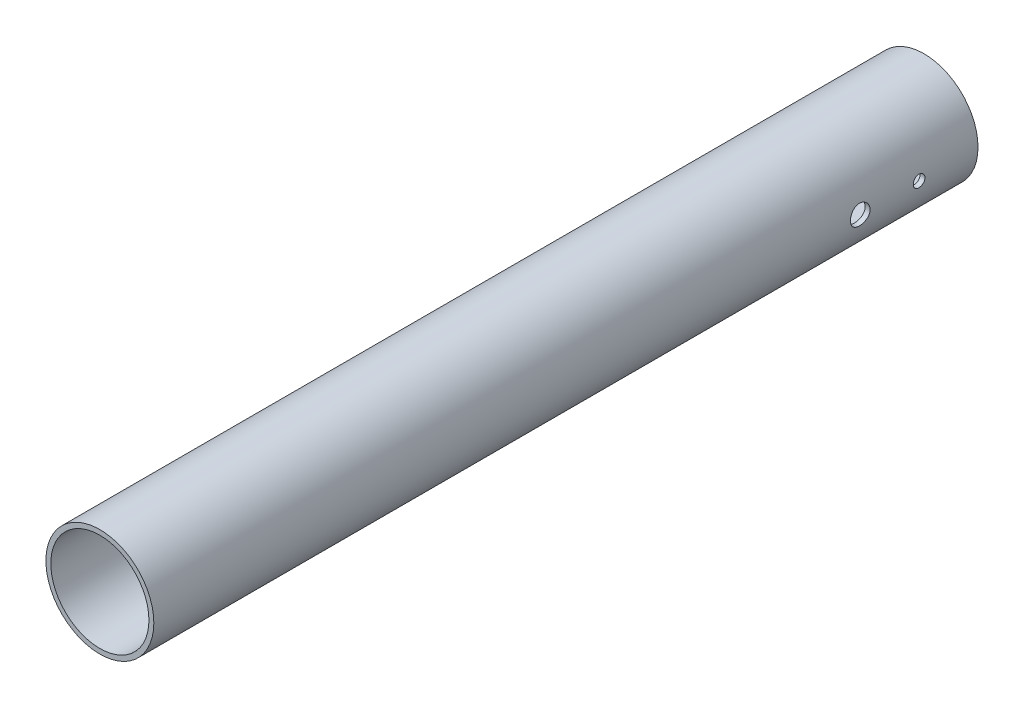
ISO-10303-21;
HEADER;
FILE_DESCRIPTION(('STEP AP214'),'2;1');
FILE_NAME('part.step','',(''),(''),'','','');
FILE_SCHEMA(('AUTOMOTIVE_DESIGN { 1 0 10303 214 1 1 1 1 }'));
ENDSEC;
DATA;
#1=APPLICATION_CONTEXT('core data for automotive mechanical design processes');
#2=APPLICATION_PROTOCOL_DEFINITION('international standard','automotive_design',2000,#1);
#3=PRODUCT_CONTEXT('',#1,'mechanical');
#4=PRODUCT('Part','Part','',(#3));
#5=PRODUCT_RELATED_PRODUCT_CATEGORY('part','',(#4));
#6=PRODUCT_DEFINITION_FORMATION('','',#4);
#7=PRODUCT_DEFINITION_CONTEXT('part definition',#1,'design');
#8=PRODUCT_DEFINITION('design','',#6,#7);
#9=PRODUCT_DEFINITION_SHAPE('','',#8);
#10=(LENGTH_UNIT() NAMED_UNIT(*) SI_UNIT(.MILLI.,.METRE.));
#11=(NAMED_UNIT(*) PLANE_ANGLE_UNIT() SI_UNIT($,.RADIAN.));
#12=(NAMED_UNIT(*) SI_UNIT($,.STERADIAN.) SOLID_ANGLE_UNIT());
#13=UNCERTAINTY_MEASURE_WITH_UNIT(LENGTH_MEASURE(1.E-05),#10,'distance_accuracy_value','');
#14=(GEOMETRIC_REPRESENTATION_CONTEXT(3) GLOBAL_UNCERTAINTY_ASSIGNED_CONTEXT((#13)) GLOBAL_UNIT_ASSIGNED_CONTEXT((#10,
#11,#12)) REPRESENTATION_CONTEXT('',''));
#15=CARTESIAN_POINT('',(0.,0.,0.));
#16=DIRECTION('',(0.,0.,1.));
#17=DIRECTION('',(1.,0.,0.));
#18=AXIS2_PLACEMENT_3D('',#15,#16,#17);
#19=CARTESIAN_POINT('',(0.,0.,266.7));
#20=DIRECTION('',(0.,0.,1.));
#21=DIRECTION('',(1.,0.,0.));
#22=AXIS2_PLACEMENT_3D('',#19,#20,#21);
#23=PLANE('',#22);
#24=CARTESIAN_POINT('',(0.,0.,266.7));
#25=DIRECTION('',(0.,0.,1.));
#26=DIRECTION('',(1.,0.,0.));
#27=AXIS2_PLACEMENT_3D('',#24,#25,#26);
#28=CIRCLE('',#27,17.4625);
#29=CARTESIAN_POINT('',(17.4625,0.,266.7));
#30=VERTEX_POINT('',#29);
#31=EDGE_CURVE('E58',#30,#30,#28,.T.);
#32=ORIENTED_EDGE('',*,*,#31,.T.);
#33=EDGE_LOOP('',(#32));
#34=FACE_BOUND('',#33,.T.);
#35=CARTESIAN_POINT('',(0.,0.,266.7));
#36=DIRECTION('',(0.,0.,1.));
#37=DIRECTION('',(1.,0.,0.));
#38=AXIS2_PLACEMENT_3D('',#35,#36,#37);
#39=CIRCLE('',#38,15.875);
#40=CARTESIAN_POINT('',(15.875,0.,266.7));
#41=VERTEX_POINT('',#40);
#42=EDGE_CURVE('E100',#41,#41,#39,.T.);
#43=ORIENTED_EDGE('',*,*,#42,.F.);
#44=EDGE_LOOP('',(#43));
#45=FACE_BOUND('',#44,.T.);
#46=ADVANCED_FACE('F43',(#34,#45),#23,.T.);
#47=CARTESIAN_POINT('',(0.,0.,0.));
#48=DIRECTION('',(0.,0.,1.));
#49=DIRECTION('',(1.,0.,0.));
#50=AXIS2_PLACEMENT_3D('',#47,#48,#49);
#51=PLANE('',#50);
#52=CARTESIAN_POINT('',(0.,0.,0.));
#53=DIRECTION('',(0.,0.,1.));
#54=DIRECTION('',(1.,0.,0.));
#55=AXIS2_PLACEMENT_3D('',#52,#53,#54);
#56=CIRCLE('',#55,17.4625);
#57=CARTESIAN_POINT('',(17.4625,0.,0.));
#58=VERTEX_POINT('',#57);
#59=EDGE_CURVE('E62',#58,#58,#56,.T.);
#60=ORIENTED_EDGE('',*,*,#59,.F.);
#61=EDGE_LOOP('',(#60));
#62=FACE_BOUND('',#61,.T.);
#63=CARTESIAN_POINT('',(0.,0.,0.));
#64=DIRECTION('',(0.,0.,1.));
#65=DIRECTION('',(1.,0.,0.));
#66=AXIS2_PLACEMENT_3D('',#63,#64,#65);
#67=CIRCLE('',#66,15.875);
#68=CARTESIAN_POINT('',(15.875,0.,0.));
#69=VERTEX_POINT('',#68);
#70=EDGE_CURVE('E99',#69,#69,#67,.T.);
#71=ORIENTED_EDGE('',*,*,#70,.T.);
#72=EDGE_LOOP('',(#71));
#73=FACE_BOUND('',#72,.T.);
#74=ADVANCED_FACE('F106',(#62,#73),#51,.F.);
#75=CARTESIAN_POINT('',(0.,0.,266.7));
#76=DIRECTION('',(0.,0.,-1.));
#77=DIRECTION('',(-1.,0.,0.));
#78=AXIS2_PLACEMENT_3D('',#75,#76,#77);
#79=CYLINDRICAL_SURFACE('',#78,17.4625);
#80=CARTESIAN_POINT('',(17.4625,0.,34.925));
#81=CARTESIAN_POINT('',(17.4624968365547,-0.176779668735442,34.9250068558738));
#82=CARTESIAN_POINT('',(17.4597877996433,-0.353649676745146,34.9398141650037));
#83=CARTESIAN_POINT('',(17.4492419540942,-0.70241224587169,34.9986178773146));
#84=CARTESIAN_POINT('',(17.4414007077203,-0.87430036478489,35.0426395421229));
#85=CARTESIAN_POINT('',(17.4214682563567,-1.20800427136557,35.1584849433527));
#86=CARTESIAN_POINT('',(17.4093807884192,-1.36982876898915,35.2302842386013));
#87=CARTESIAN_POINT('',(17.3822784100355,-1.6791178053729,35.399578888267));
#88=CARTESIAN_POINT('',(17.3672637641222,-1.82658363994048,35.4970719209863));
#89=CARTESIAN_POINT('',(17.3357767568098,-2.1046510493134,35.7161558815578));
#90=CARTESIAN_POINT('',(17.3192911899786,-2.23506700882811,35.8379805241445));
#91=CARTESIAN_POINT('',(17.2868192364874,-2.47372754778962,36.1017666871176));
#92=CARTESIAN_POINT('',(17.2708328844662,-2.58197059162026,36.2437296010565));
#93=CARTESIAN_POINT('',(17.24104121333,-2.77397678338656,36.5450639580174));
#94=CARTESIAN_POINT('',(17.2272529328728,-2.85755259809069,36.7045565996782));
#95=CARTESIAN_POINT('',(17.2036038845208,-2.9966530578309,37.0356108573893));
#96=CARTESIAN_POINT('',(17.1937427990208,-3.05217997137198,37.2071714961398));
#97=CARTESIAN_POINT('',(17.1791971870777,-3.13301376366712,37.5555107558536));
#98=CARTESIAN_POINT('',(17.1744574058797,-3.15864345450393,37.732212114339));
#99=CARTESIAN_POINT('',(17.1705243239879,-3.17995694869492,38.0874657466119));
#100=CARTESIAN_POINT('',(17.1713305558931,-3.17564327558419,38.2660178631567));
#101=CARTESIAN_POINT('',(17.1783480576557,-3.13745458402862,38.6175756636862));
#102=CARTESIAN_POINT('',(17.1844924409264,-3.10394536847276,38.7906226152845));
#103=CARTESIAN_POINT('',(17.2013889727233,-3.00889230802291,39.1285968416579));
#104=CARTESIAN_POINT('',(17.212141306413,-2.9473473365481,39.293523789846));
#105=CARTESIAN_POINT('',(17.2371128071494,-2.79760835240506,39.6116536803612));
#106=CARTESIAN_POINT('',(17.2513512559653,-2.70926544714818,39.7647849652325));
#107=CARTESIAN_POINT('',(17.281677749436,-2.50854374106292,40.0541882699007));
#108=CARTESIAN_POINT('',(17.2977659708751,-2.39616264199939,40.1904586757009));
#109=CARTESIAN_POINT('',(17.3302714228357,-2.14857646576633,40.4443866568554));
#110=CARTESIAN_POINT('',(17.3466899988364,-2.01305822409282,40.5617389303936));
#111=CARTESIAN_POINT('',(17.3777870381888,-1.72409570835062,40.7720881494008));
#112=CARTESIAN_POINT('',(17.392465486011,-1.57065127432832,40.8650848775238));
#113=CARTESIAN_POINT('',(17.4184554129773,-1.24988256261445,41.0241232312837));
#114=CARTESIAN_POINT('',(17.4297630918777,-1.08254288887784,41.0901344640549));
#115=CARTESIAN_POINT('',(17.4477077618503,-0.738899357959478,41.1930265680837));
#116=CARTESIAN_POINT('',(17.4543452190194,-0.562596397214249,41.2299103463611));
#117=CARTESIAN_POINT('',(17.4621379448862,-0.208658856205865,41.2730787470466));
#118=CARTESIAN_POINT('',(17.4633681932907,-0.03107691922293,41.2797819047333));
#119=CARTESIAN_POINT('',(17.4604145051791,0.322670866866413,41.2635195203869));
#120=CARTESIAN_POINT('',(17.4562308181758,0.49883678085677,41.2405553456361));
#121=CARTESIAN_POINT('',(17.4429659495402,0.843434142428505,41.1659581975705));
#122=CARTESIAN_POINT('',(17.4339207387081,1.01191265971508,41.1145357076723));
#123=CARTESIAN_POINT('',(17.4119428100653,1.33785723308862,40.9847084347214));
#124=CARTESIAN_POINT('',(17.3990098407924,1.49532257602551,40.9063019062799));
#125=CARTESIAN_POINT('',(17.3705040509094,1.79656620473146,40.7237967624878));
#126=CARTESIAN_POINT('',(17.3549053081318,1.94018606768474,40.61944078414));
#127=CARTESIAN_POINT('',(17.3228680731285,2.20802539442976,40.3883489020346));
#128=CARTESIAN_POINT('',(17.3064295075713,2.33224316021752,40.2616110415585));
#129=CARTESIAN_POINT('',(17.2743183779776,2.55933158896691,39.9874630757005));
#130=CARTESIAN_POINT('',(17.2586578899349,2.66191740827001,39.8398153758902));
#131=CARTESIAN_POINT('',(17.2301139725362,2.84083103651321,39.5291370620172));
#132=CARTESIAN_POINT('',(17.2172304439237,2.91715978401387,39.3661069980635));
#133=CARTESIAN_POINT('',(17.1957927707707,3.04098238071272,39.0300356848644));
#134=CARTESIAN_POINT('',(17.1872185785159,3.0886099623067,38.8570450462033));
#135=CARTESIAN_POINT('',(17.1753232589081,3.15409326283453,38.5053475055482));
#136=CARTESIAN_POINT('',(17.1720015781303,3.17195211832635,38.3266412078023));
#137=CARTESIAN_POINT('',(17.1710142653865,3.17729097940304,37.9714357164515));
#138=CARTESIAN_POINT('',(17.1732650333878,3.16521999989456,37.7949433465913));
#139=CARTESIAN_POINT('',(17.1829842513591,3.11202144474092,37.4465474746474));
#140=CARTESIAN_POINT('',(17.1904526744775,3.07089401862826,37.2746439489528));
#141=CARTESIAN_POINT('',(17.2097314567845,2.96093462864081,36.9405277866348));
#142=CARTESIAN_POINT('',(17.2215346338835,2.8921484736803,36.7782996331453));
#143=CARTESIAN_POINT('',(17.2481585680482,2.72887239442906,36.467614315126));
#144=CARTESIAN_POINT('',(17.2629795205642,2.63438080515798,36.3191580434576));
#145=CARTESIAN_POINT('',(17.294230153842,2.42080325564693,36.0379758115795));
#146=CARTESIAN_POINT('',(17.3106795618188,2.30138947190544,35.9055010078302));
#147=CARTESIAN_POINT('',(17.3431833740898,2.04204334134589,35.6623190088932));
#148=CARTESIAN_POINT('',(17.3592376867117,1.90210628404647,35.5516168246273));
#149=CARTESIAN_POINT('',(17.3892999669679,1.60428176356349,35.3542595283165));
#150=CARTESIAN_POINT('',(17.4032896341282,1.44625353654241,35.2678139810266));
#151=CARTESIAN_POINT('',(17.4274680182694,1.11771732432456,35.1228354944824));
#152=CARTESIAN_POINT('',(17.4376603650327,0.947221444210081,35.0642758846457));
#153=CARTESIAN_POINT('',(17.4509758672268,0.646813777265212,34.9888565043953));
#154=CARTESIAN_POINT('',(17.4552733868431,0.518676615801422,34.9649504964255));
#155=CARTESIAN_POINT('',(17.4610365858746,0.26037594313487,34.9330199011006));
#156=CARTESIAN_POINT('',(17.4625023301325,0.130212478399821,34.9249949500962));
#157=CARTESIAN_POINT('',(17.4625,0.,34.925));
#158=B_SPLINE_CURVE_WITH_KNOTS('',3,(#80,#81,#82,#83,#84,#85,#86,#87,#88,#89,#90,#91,#92,#93,
#94,#95,#96,#97,#98,#99,#100,#101,#102,#103,#104,#105,#106,#107,#108,#109,#110,#111,#112,#113,
#114,#115,#116,#117,#118,#119,#120,#121,#122,#123,#124,#125,#126,#127,#128,#129,#130,#131,#132,
#133,#134,#135,#136,#137,#138,#139,#140,#141,#142,#143,#144,#145,#146,#147,#148,#149,#150,#151,
#152,#153,#154,#155,#156,#157),.UNSPECIFIED.,.T.,.F.,(4,2,2,2,2,2,2,2,2,2,2,2,2,2,2,2,2,2,2,2,2,
2,2,2,2,2,2,2,2,2,2,2,2,2,2,2,2,2,4),(0.,0.529862877839326,1.06018452566524,1.59004060780096,
2.11984882830488,2.65501460672554,3.19021743627636,3.72938599123294,4.26851093298471,
4.80175921111573,5.3349625492592,5.86157970574294,6.38821802552706,6.91783774007829,
7.4475081129749,7.9850172157647,8.52253111506124,9.06064874150299,9.59871265517554,
10.1292914158331,10.6598457245064,11.1865273996562,11.7132431481782,12.2454071003812,
12.7776175996559,13.316450159821,13.855263457383,14.3915463545839,14.9277727431946,
15.4560033419696,15.984231222344,16.511587821611,17.0389785867083,17.5738014431643,
18.1087472442927,18.6481815971189,19.1870989844083,19.5773946498942,19.9676813781648),.UNSPECIFIED.);
#159=CARTESIAN_POINT('',(17.4625,0.,34.925));
#160=VERTEX_POINT('',#159);
#161=EDGE_CURVE('E91',#160,#160,#158,.T.);
#162=ORIENTED_EDGE('',*,*,#161,.T.);
#163=EDGE_LOOP('',(#162));
#164=FACE_BOUND('',#163,.T.);
#165=CARTESIAN_POINT('',(-17.4625,0.,17.15135));
#166=CARTESIAN_POINT('',(-17.4624986821451,0.106311372633014,17.1513545774759));
#167=CARTESIAN_POINT('',(-17.4615188718321,0.212691786348273,17.1603091383411));
#168=CARTESIAN_POINT('',(-17.4577044403444,0.422499792387614,17.1958934597173));
#169=CARTESIAN_POINT('',(-17.4548678102977,0.52592405986704,17.2225423639838));
#170=CARTESIAN_POINT('',(-17.447659735898,0.726751432191771,17.2927273237994));
#171=CARTESIAN_POINT('',(-17.4432892532474,0.824158264977963,17.3362527997814));
#172=CARTESIAN_POINT('',(-17.4335013217336,1.01026376509616,17.4389339565755));
#173=CARTESIAN_POINT('',(-17.4280840717971,1.09896408218467,17.4980866683845));
#174=CARTESIAN_POINT('',(-17.4167832383032,1.26553318553436,17.6306105676717));
#175=CARTESIAN_POINT('',(-17.4108979793826,1.34336003079096,17.7040343329506));
#176=CARTESIAN_POINT('',(-17.3993381726003,1.48561223065963,17.862903639779));
#177=CARTESIAN_POINT('',(-17.3936636348044,1.5500369457458,17.9483497546879));
#178=CARTESIAN_POINT('',(-17.3831509034779,1.66380742716167,18.1291043977214));
#179=CARTESIAN_POINT('',(-17.378314854926,1.71311476127579,18.2244372512924));
#180=CARTESIAN_POINT('',(-17.3700479520775,1.7950054257674,18.4220910278585));
#181=CARTESIAN_POINT('',(-17.3666170570991,1.82758924032731,18.5244117484424));
#182=CARTESIAN_POINT('',(-17.361564406221,1.87498246217823,18.7327061373033));
#183=CARTESIAN_POINT('',(-17.3599355235533,1.88986190615933,18.8386636943203));
#184=CARTESIAN_POINT('',(-17.3586493250886,1.90164058370022,19.0515836908483));
#185=CARTESIAN_POINT('',(-17.3589919486032,1.89854037072352,19.158546099326));
#186=CARTESIAN_POINT('',(-17.3616035353891,1.8745053849101,19.369955032524));
#187=CARTESIAN_POINT('',(-17.3638642153147,1.85364730013747,19.4744103926375));
#188=CARTESIAN_POINT('',(-17.3700442648568,1.79480808646627,19.6783291677378));
#189=CARTESIAN_POINT('',(-17.3739636605384,1.75682668848983,19.7777925042518));
#190=CARTESIAN_POINT('',(-17.3830290181591,1.66473507436623,19.9691447878707));
#191=CARTESIAN_POINT('',(-17.3881775457125,1.61059106137483,20.0610173431643));
#192=CARTESIAN_POINT('',(-17.3991189582315,1.48773541518309,20.2344006887188));
#193=CARTESIAN_POINT('',(-17.404911865502,1.41902327763859,20.3159111200896));
#194=CARTESIAN_POINT('',(-17.4165262159436,1.26855461948957,20.4667019043571));
#195=CARTESIAN_POINT('',(-17.4223476503045,1.18673191036093,20.5359162279615));
#196=CARTESIAN_POINT('',(-17.4333346803703,1.01259395636218,20.6596375224946));
#197=CARTESIAN_POINT('',(-17.438500275121,0.920278696227193,20.7141444720261));
#198=CARTESIAN_POINT('',(-17.44759576036,0.727728706302387,20.8069019894424));
#199=CARTESIAN_POINT('',(-17.4515253768348,0.627492226551291,20.8451489531868));
#200=CARTESIAN_POINT('',(-17.4577034685096,0.421967837221238,20.9042511159496));
#201=CARTESIAN_POINT('',(-17.4599520031745,0.31668010646015,20.9251069301474));
#202=CARTESIAN_POINT('',(-17.4625069170405,0.104613469786396,20.9487504206056));
#203=CARTESIAN_POINT('',(-17.4628230846109,-0.00215517020495317,20.9516291610136));
#204=CARTESIAN_POINT('',(-17.4615039467121,-0.214654444977976,20.9394763348508));
#205=CARTESIAN_POINT('',(-17.459868672504,-0.320385096360396,20.9244450551903));
#206=CARTESIAN_POINT('',(-17.4548365972759,-0.527542350775093,20.8769744562384));
#207=CARTESIAN_POINT('',(-17.451444137249,-0.628978897096755,20.8445780293736));
#208=CARTESIAN_POINT('',(-17.4432780082058,-0.824978253014618,20.7633409970123));
#209=CARTESIAN_POINT('',(-17.4385043029402,-0.919540882131272,20.7144999599405));
#210=CARTESIAN_POINT('',(-17.4280846546496,-1.09951822553585,20.6015360760932));
#211=CARTESIAN_POINT('',(-17.4224353446641,-1.18489537635091,20.537353697772));
#212=CARTESIAN_POINT('',(-17.410908505824,-1.34369735490082,20.3956140199224));
#213=CARTESIAN_POINT('',(-17.4050309701782,-1.41712182663473,20.3180563221626));
#214=CARTESIAN_POINT('',(-17.3936804141136,-1.55025263330474,20.1513689891746));
#215=CARTESIAN_POINT('',(-17.3882092296584,-1.60989900512838,20.0621913194277));
#216=CARTESIAN_POINT('',(-17.3783195598482,-1.71336760182696,19.8750311355606));
#217=CARTESIAN_POINT('',(-17.3739010578609,-1.75719007672148,19.7770487605864));
#218=CARTESIAN_POINT('',(-17.3666288805536,-1.82766760063779,19.5752622122543));
#219=CARTESIAN_POINT('',(-17.3637720104029,-1.85435771917716,19.4714704075046));
#220=CARTESIAN_POINT('',(-17.3599369112579,-1.88992642409395,19.2608456088261));
#221=CARTESIAN_POINT('',(-17.3589586176373,-1.89880562319882,19.1540127196443));
#222=CARTESIAN_POINT('',(-17.3589929772254,-1.89849105538954,18.940934484786));
#223=CARTESIAN_POINT('',(-17.3599952540457,-1.8893914809389,18.8346889859058));
#224=CARTESIAN_POINT('',(-17.3638556401929,-1.85357580353113,18.6252460194348));
#225=CARTESIAN_POINT('',(-17.3667137510684,-1.82685968587455,18.5220485543873));
#226=CARTESIAN_POINT('',(-17.3739607842917,-1.75659644359111,18.3216356181213));
#227=CARTESIAN_POINT('',(-17.378349401633,-1.71305267227299,18.2244189595567));
#228=CARTESIAN_POINT('',(-17.3881635462595,-1.61037965910209,18.0386583886224));
#229=CARTESIAN_POINT('',(-17.393589073894,-1.55125041199989,17.9501144791738));
#230=CARTESIAN_POINT('',(-17.4048997988303,-1.41873227509885,17.7837303238077));
#231=CARTESIAN_POINT('',(-17.4107871717237,-1.34527313090026,17.705946178279));
#232=CARTESIAN_POINT('',(-17.4223385328391,-1.18632293558526,17.5637696229038));
#233=CARTESIAN_POINT('',(-17.4280024675129,-1.10082902242493,17.4993804076192));
#234=CARTESIAN_POINT('',(-17.4384864245596,-0.919957303042269,17.3856685759379));
#235=CARTESIAN_POINT('',(-17.4433039313041,-0.824551331511115,17.3363905578111));
#236=CARTESIAN_POINT('',(-17.4515256611452,-0.626824845242574,17.2546217641012));
#237=CARTESIAN_POINT('',(-17.4549314582437,-0.524512180074163,17.2221122823037));
#238=CARTESIAN_POINT('',(-17.4591014472166,-0.351363199901973,17.1828052305934));
#239=CARTESIAN_POINT('',(-17.4603698761509,-0.281629224733035,17.1710259032439));
#240=CARTESIAN_POINT('',(-17.4620695883174,-0.141273660975594,17.1552967868553));
#241=CARTESIAN_POINT('',(-17.4625008758159,-0.0706520769123782,17.1513469579155));
#242=CARTESIAN_POINT('',(-17.4625,0.,17.15135));
#243=B_SPLINE_CURVE_WITH_KNOTS('',3,(#165,#166,#167,#168,#169,#170,#171,#172,#173,#174,#175,
#176,#177,#178,#179,#180,#181,#182,#183,#184,#185,#186,#187,#188,#189,#190,#191,#192,#193,#194,
#195,#196,#197,#198,#199,#200,#201,#202,#203,#204,#205,#206,#207,#208,#209,#210,#211,#212,#213,
#214,#215,#216,#217,#218,#219,#220,#221,#222,#223,#224,#225,#226,#227,#228,#229,#230,#231,#232,
#233,#234,#235,#236,#237,#238,#239,#240,#241,#242),.UNSPECIFIED.,.T.,.F.,(4,2,2,2,2,2,2,2,2,2,2,
2,2,2,2,2,2,2,2,2,2,2,2,2,2,2,2,2,2,2,2,2,2,2,2,2,2,2,4),(0.,0.318676099332633,
0.637697541782703,0.956519318905976,1.27528056690085,1.59523926045681,1.91521321837427,
2.23599401215495,2.55676551810716,2.87626382043447,3.19575228777381,3.51386798977354,
3.83198869085722,4.1507793144867,4.46958097635559,4.79004598481845,5.11051145950985,
5.43104793064331,5.75157306291921,6.07047322638434,6.38936828128356,6.7074792613908,
7.02559859071182,7.34497300587152,7.66435693160156,7.98510569373848,8.30584938778253,
8.62593441573394,8.94600843199941,9.2644099970217,9.58281182772247,9.90115024200366,
10.219488763506,10.5394290966737,10.8594456452745,11.1803977776452,11.5009910918601,
11.7127769287397,11.9245616863113),.UNSPECIFIED.);
#244=CARTESIAN_POINT('',(-17.4625,0.,17.15135));
#245=VERTEX_POINT('',#244);
#246=EDGE_CURVE('E11',#245,#245,#243,.T.);
#247=ORIENTED_EDGE('',*,*,#246,.T.);
#248=EDGE_LOOP('',(#247));
#249=FACE_BOUND('',#248,.T.);
#250=CARTESIAN_POINT('',(17.4625,0.,17.15135));
#251=CARTESIAN_POINT('',(17.4624986821451,-0.106311372633014,17.1513545774759));
#252=CARTESIAN_POINT('',(17.4615188718321,-0.212691786348273,17.1603091383411));
#253=CARTESIAN_POINT('',(17.4577044403444,-0.422499792387614,17.1958934597173));
#254=CARTESIAN_POINT('',(17.4548678102977,-0.52592405986704,17.2225423639838));
#255=CARTESIAN_POINT('',(17.447659735898,-0.726751432191771,17.2927273237994));
#256=CARTESIAN_POINT('',(17.4432892532474,-0.824158264977963,17.3362527997814));
#257=CARTESIAN_POINT('',(17.4335013217336,-1.01026376509616,17.4389339565755));
#258=CARTESIAN_POINT('',(17.4280840717971,-1.09896408218467,17.4980866683845));
#259=CARTESIAN_POINT('',(17.4167832383032,-1.26553318553436,17.6306105676717));
#260=CARTESIAN_POINT('',(17.4108979793826,-1.34336003079096,17.7040343329506));
#261=CARTESIAN_POINT('',(17.3993381726003,-1.48561223065963,17.862903639779));
#262=CARTESIAN_POINT('',(17.3936636348044,-1.5500369457458,17.9483497546879));
#263=CARTESIAN_POINT('',(17.3831509034779,-1.66380742716167,18.1291043977214));
#264=CARTESIAN_POINT('',(17.378314854926,-1.71311476127579,18.2244372512924));
#265=CARTESIAN_POINT('',(17.3700479520775,-1.7950054257674,18.4220910278585));
#266=CARTESIAN_POINT('',(17.3666170570991,-1.82758924032731,18.5244117484424));
#267=CARTESIAN_POINT('',(17.361564406221,-1.87498246217823,18.7327061373033));
#268=CARTESIAN_POINT('',(17.3599355235533,-1.88986190615933,18.8386636943203));
#269=CARTESIAN_POINT('',(17.3586493250886,-1.90164058370022,19.0515836908483));
#270=CARTESIAN_POINT('',(17.3589919486032,-1.89854037072352,19.158546099326));
#271=CARTESIAN_POINT('',(17.3616035353891,-1.8745053849101,19.369955032524));
#272=CARTESIAN_POINT('',(17.3638642153147,-1.85364730013747,19.4744103926375));
#273=CARTESIAN_POINT('',(17.3700442648568,-1.79480808646627,19.6783291677378));
#274=CARTESIAN_POINT('',(17.3739636605384,-1.75682668848983,19.7777925042518));
#275=CARTESIAN_POINT('',(17.3830290181591,-1.66473507436623,19.9691447878707));
#276=CARTESIAN_POINT('',(17.3881775457125,-1.61059106137483,20.0610173431643));
#277=CARTESIAN_POINT('',(17.3991189582315,-1.48773541518309,20.2344006887188));
#278=CARTESIAN_POINT('',(17.404911865502,-1.41902327763859,20.3159111200896));
#279=CARTESIAN_POINT('',(17.4165262159436,-1.26855461948957,20.4667019043571));
#280=CARTESIAN_POINT('',(17.4223476503045,-1.18673191036093,20.5359162279615));
#281=CARTESIAN_POINT('',(17.4333346803703,-1.01259395636218,20.6596375224946));
#282=CARTESIAN_POINT('',(17.438500275121,-0.920278696227193,20.7141444720261));
#283=CARTESIAN_POINT('',(17.44759576036,-0.727728706302387,20.8069019894424));
#284=CARTESIAN_POINT('',(17.4515253768348,-0.627492226551291,20.8451489531868));
#285=CARTESIAN_POINT('',(17.4577034685096,-0.421967837221238,20.9042511159496));
#286=CARTESIAN_POINT('',(17.4599520031745,-0.31668010646015,20.9251069301474));
#287=CARTESIAN_POINT('',(17.4625069170405,-0.104613469786396,20.9487504206056));
#288=CARTESIAN_POINT('',(17.4628230846109,0.00215517020495317,20.9516291610136));
#289=CARTESIAN_POINT('',(17.4615039467121,0.214654444977976,20.9394763348508));
#290=CARTESIAN_POINT('',(17.459868672504,0.320385096360396,20.9244450551903));
#291=CARTESIAN_POINT('',(17.4548365972759,0.527542350775093,20.8769744562384));
#292=CARTESIAN_POINT('',(17.451444137249,0.628978897096755,20.8445780293736));
#293=CARTESIAN_POINT('',(17.4432780082058,0.824978253014618,20.7633409970123));
#294=CARTESIAN_POINT('',(17.4385043029402,0.919540882131272,20.7144999599405));
#295=CARTESIAN_POINT('',(17.4280846546496,1.09951822553585,20.6015360760932));
#296=CARTESIAN_POINT('',(17.4224353446641,1.18489537635091,20.537353697772));
#297=CARTESIAN_POINT('',(17.410908505824,1.34369735490082,20.3956140199224));
#298=CARTESIAN_POINT('',(17.4050309701782,1.41712182663473,20.3180563221626));
#299=CARTESIAN_POINT('',(17.3936804141136,1.55025263330474,20.1513689891746));
#300=CARTESIAN_POINT('',(17.3882092296584,1.60989900512838,20.0621913194277));
#301=CARTESIAN_POINT('',(17.3783195598482,1.71336760182696,19.8750311355606));
#302=CARTESIAN_POINT('',(17.3739010578609,1.75719007672148,19.7770487605864));
#303=CARTESIAN_POINT('',(17.3666288805536,1.82766760063779,19.5752622122543));
#304=CARTESIAN_POINT('',(17.3637720104029,1.85435771917716,19.4714704075046));
#305=CARTESIAN_POINT('',(17.3599369112579,1.88992642409395,19.2608456088261));
#306=CARTESIAN_POINT('',(17.3589586176373,1.89880562319882,19.1540127196443));
#307=CARTESIAN_POINT('',(17.3589929772254,1.89849105538954,18.940934484786));
#308=CARTESIAN_POINT('',(17.3599952540457,1.8893914809389,18.8346889859058));
#309=CARTESIAN_POINT('',(17.3638556401929,1.85357580353113,18.6252460194348));
#310=CARTESIAN_POINT('',(17.3667137510684,1.82685968587455,18.5220485543873));
#311=CARTESIAN_POINT('',(17.3739607842917,1.75659644359111,18.3216356181213));
#312=CARTESIAN_POINT('',(17.378349401633,1.71305267227299,18.2244189595567));
#313=CARTESIAN_POINT('',(17.3881635462595,1.61037965910209,18.0386583886224));
#314=CARTESIAN_POINT('',(17.393589073894,1.55125041199989,17.9501144791738));
#315=CARTESIAN_POINT('',(17.4048997988303,1.41873227509885,17.7837303238077));
#316=CARTESIAN_POINT('',(17.4107871717237,1.34527313090026,17.705946178279));
#317=CARTESIAN_POINT('',(17.4223385328391,1.18632293558526,17.5637696229038));
#318=CARTESIAN_POINT('',(17.4280024675129,1.10082902242493,17.4993804076192));
#319=CARTESIAN_POINT('',(17.4384864245596,0.919957303042269,17.3856685759379));
#320=CARTESIAN_POINT('',(17.4433039313041,0.824551331511115,17.3363905578111));
#321=CARTESIAN_POINT('',(17.4515256611452,0.626824845242574,17.2546217641012));
#322=CARTESIAN_POINT('',(17.4549314582437,0.524512180074163,17.2221122823037));
#323=CARTESIAN_POINT('',(17.4591014472166,0.351363199901973,17.1828052305934));
#324=CARTESIAN_POINT('',(17.4603698761509,0.281629224733035,17.1710259032439));
#325=CARTESIAN_POINT('',(17.4620695883174,0.141273660975594,17.1552967868553));
#326=CARTESIAN_POINT('',(17.4625008758159,0.0706520769123782,17.1513469579155));
#327=CARTESIAN_POINT('',(17.4625,0.,17.15135));
#328=B_SPLINE_CURVE_WITH_KNOTS('',3,(#250,#251,#252,#253,#254,#255,#256,#257,#258,#259,#260,
#261,#262,#263,#264,#265,#266,#267,#268,#269,#270,#271,#272,#273,#274,#275,#276,#277,#278,#279,
#280,#281,#282,#283,#284,#285,#286,#287,#288,#289,#290,#291,#292,#293,#294,#295,#296,#297,#298,
#299,#300,#301,#302,#303,#304,#305,#306,#307,#308,#309,#310,#311,#312,#313,#314,#315,#316,#317,
#318,#319,#320,#321,#322,#323,#324,#325,#326,#327),.UNSPECIFIED.,.T.,.F.,(4,2,2,2,2,2,2,2,2,2,2,
2,2,2,2,2,2,2,2,2,2,2,2,2,2,2,2,2,2,2,2,2,2,2,2,2,2,2,4),(0.,0.318676099332633,
0.637697541782703,0.956519318905976,1.27528056690085,1.59523926045681,1.91521321837427,
2.23599401215495,2.55676551810716,2.87626382043447,3.19575228777381,3.51386798977354,
3.83198869085722,4.1507793144867,4.46958097635559,4.79004598481845,5.11051145950985,
5.43104793064331,5.75157306291921,6.07047322638434,6.38936828128356,6.7074792613908,
7.02559859071182,7.34497300587152,7.66435693160156,7.98510569373848,8.30584938778253,
8.62593441573394,8.94600843199941,9.2644099970217,9.58281182772247,9.90115024200366,
10.219488763506,10.5394290966737,10.8594456452745,11.1803977776452,11.5009910918601,
11.7127769287397,11.9245616863113),.UNSPECIFIED.);
#329=CARTESIAN_POINT('',(17.4625,0.,17.15135));
#330=VERTEX_POINT('',#329);
#331=EDGE_CURVE('E54',#330,#330,#328,.T.);
#332=ORIENTED_EDGE('',*,*,#331,.T.);
#333=EDGE_LOOP('',(#332));
#334=FACE_BOUND('',#333,.T.);
#335=ORIENTED_EDGE('',*,*,#31,.F.);
#336=EDGE_LOOP('',(#335));
#337=FACE_BOUND('',#336,.T.);
#338=ORIENTED_EDGE('',*,*,#59,.T.);
#339=EDGE_LOOP('',(#338));
#340=FACE_BOUND('',#339,.T.);
#341=ADVANCED_FACE('F45',(#164,#249,#334,#337,#340),#79,.T.);
#342=CARTESIAN_POINT('',(0.,0.,266.7));
#343=DIRECTION('',(0.,0.,-1.));
#344=DIRECTION('',(-1.,0.,0.));
#345=AXIS2_PLACEMENT_3D('',#342,#343,#344);
#346=CYLINDRICAL_SURFACE('',#345,15.875);
#347=CARTESIAN_POINT('',(15.875,0.,34.925));
#348=CARTESIAN_POINT('',(15.8749967481927,-0.17645667906661,34.9250064912823));
#349=CARTESIAN_POINT('',(15.8720277294088,-0.352995421139834,34.9397600764223));
#350=CARTESIAN_POINT('',(15.8604701085376,-0.701082886912636,34.9983377378659));
#351=CARTESIAN_POINT('',(15.8518770420609,-0.872627533193803,35.0421849091448));
#352=CARTESIAN_POINT('',(15.8300308645856,-1.20564371921102,35.157541043746));
#353=CARTESIAN_POINT('',(15.8167822181858,-1.3671247356877,35.2290235119819));
#354=CARTESIAN_POINT('',(15.7870651376212,-1.67579036464392,35.3975423858484));
#355=CARTESIAN_POINT('',(15.7705968952337,-1.8229758278657,35.4945772695529));
#356=CARTESIAN_POINT('',(15.7360037492265,-2.10087679047469,35.7128397193753));
#357=CARTESIAN_POINT('',(15.717861169763,-2.23137079492831,35.8343465283671));
#358=CARTESIAN_POINT('',(15.6820927293697,-2.47026670223048,36.0975034220437));
#359=CARTESIAN_POINT('',(15.6644669088885,-2.57866687964609,36.239155078489));
#360=CARTESIAN_POINT('',(15.6315550275505,-2.77124081687869,36.5401739128127));
#361=CARTESIAN_POINT('',(15.616291708837,-2.85518523089912,36.6996905190534));
#362=CARTESIAN_POINT('',(15.5900840108548,-2.99499549139247,37.030919775338));
#363=CARTESIAN_POINT('',(15.5791392049423,-3.05086411173822,37.2026312186247));
#364=CARTESIAN_POINT('',(15.5629865667575,-3.13221782713432,37.5509928554076));
#365=CARTESIAN_POINT('',(15.5577054259032,-3.15809153101911,37.7275488276516));
#366=CARTESIAN_POINT('',(15.5532574081749,-3.17992800553042,38.0825686828318));
#367=CARTESIAN_POINT('',(15.5540899061039,-3.17589383461536,38.2610323688165));
#368=CARTESIAN_POINT('',(15.5617084989549,-3.13834326959827,38.6119585519667));
#369=CARTESIAN_POINT('',(15.5684046282657,-3.10527236527439,38.7844709628667));
#370=CARTESIAN_POINT('',(15.58685434058,-3.01129028367818,39.121448543405));
#371=CARTESIAN_POINT('',(15.5986081651095,-2.95037777684465,39.2859133283179));
#372=CARTESIAN_POINT('',(15.625940887388,-2.80201618816723,39.6034109559089));
#373=CARTESIAN_POINT('',(15.6415451015851,-2.71439053016195,39.7563590176321));
#374=CARTESIAN_POINT('',(15.6748041460447,-2.51521459926825,40.0455474486637));
#375=CARTESIAN_POINT('',(15.6924592118681,-2.40366157683292,40.1817858950024));
#376=CARTESIAN_POINT('',(15.7282204244164,-2.15741229222985,40.4362583528008));
#377=CARTESIAN_POINT('',(15.7463289724462,-2.02233581184951,40.5541244029527));
#378=CARTESIAN_POINT('',(15.7806659466825,-1.73413745139688,40.7655834620064));
#379=CARTESIAN_POINT('',(15.7968943487749,-1.58101533992956,40.8591761596071));
#380=CARTESIAN_POINT('',(15.8256824126082,-1.26066355334057,41.0194998417925));
#381=CARTESIAN_POINT('',(15.8382363209326,-1.09341227718332,41.0861887623214));
#382=CARTESIAN_POINT('',(15.8582172353645,-0.749773000224506,41.1904195050724));
#383=CARTESIAN_POINT('',(15.8656448625169,-0.573386108980024,41.2279648580838));
#384=CARTESIAN_POINT('',(15.8744498317731,-0.2196446128662,41.2723217407968));
#385=CARTESIAN_POINT('',(15.8759262952159,-0.0423555424337026,41.2796368320403));
#386=CARTESIAN_POINT('',(15.8729378987808,0.310911666061869,41.2646816978586));
#387=CARTESIAN_POINT('',(15.8684733728909,0.486889877259045,41.2424131355555));
#388=CARTESIAN_POINT('',(15.8541666662546,0.830915470330268,41.1693411639979));
#389=CARTESIAN_POINT('',(15.8443732008336,0.999019935979191,41.1187961325192));
#390=CARTESIAN_POINT('',(15.8205027779378,1.32436751731144,40.9908883550678));
#391=CARTESIAN_POINT('',(15.8064254995517,1.48160981819919,40.9135235999011));
#392=CARTESIAN_POINT('',(15.7753021911821,1.78289322645374,40.7330830921821));
#393=CARTESIAN_POINT('',(15.7582219263764,1.92674915243819,40.6297041702013));
#394=CARTESIAN_POINT('',(15.7230678308488,2.19525221070348,40.4005758179169));
#395=CARTESIAN_POINT('',(15.7049938937463,2.31989728085517,40.2748239891804));
#396=CARTESIAN_POINT('',(15.6695553879336,2.54838387570801,40.0022271077457));
#397=CARTESIAN_POINT('',(15.6522058124074,2.65187970527447,39.8550900120972));
#398=CARTESIAN_POINT('',(15.6204980895292,2.83268870866257,39.5452239276925));
#399=CARTESIAN_POINT('',(15.6061398224986,2.91000293005521,39.382495563104));
#400=CARTESIAN_POINT('',(15.5821615135542,3.03578209702272,39.0468858184752));
#401=CARTESIAN_POINT('',(15.5725169521919,3.08439661183658,38.8740623291572));
#402=CARTESIAN_POINT('',(15.5590061181468,3.15184996891634,38.5224862851664));
#403=CARTESIAN_POINT('',(15.5551390919428,3.17069269411472,38.3437345067853));
#404=CARTESIAN_POINT('',(15.5536630007963,3.1779238920042,37.9888468550718));
#405=CARTESIAN_POINT('',(15.5559416842603,3.16685862712509,37.8127223521567));
#406=CARTESIAN_POINT('',(15.5662494581365,3.11579356551768,37.4648995115515));
#407=CARTESIAN_POINT('',(15.5742785023576,3.07579400121051,37.293201138319));
#408=CARTESIAN_POINT('',(15.5951321389583,2.96823945498417,36.9594520168113));
#409=CARTESIAN_POINT('',(15.6079450673479,2.90075145882756,36.7973789054048));
#410=CARTESIAN_POINT('',(15.6369294504299,2.74019849661008,36.4867706866681));
#411=CARTESIAN_POINT('',(15.6531011867149,2.64713138586024,36.3382367159227));
#412=CARTESIAN_POINT('',(15.6873244966124,2.43619627944686,36.0562030584228));
#413=CARTESIAN_POINT('',(15.705403339883,2.31793379197169,35.9230016702754));
#414=CARTESIAN_POINT('',(15.7412080994346,2.06077937161671,35.6781537974449));
#415=CARTESIAN_POINT('',(15.7589339336561,1.92188270421183,35.5665122732427));
#416=CARTESIAN_POINT('',(15.7922541783181,1.62565597235518,35.36685000547));
#417=CARTESIAN_POINT('',(15.8078243412111,1.46814820806472,35.2790886895859));
#418=CARTESIAN_POINT('',(15.8348402214487,1.14035319598682,35.1314190607558));
#419=CARTESIAN_POINT('',(15.8462896541511,0.970077628240422,35.0714856432343));
#420=CARTESIAN_POINT('',(15.861549829903,0.666183227332998,34.992780064958));
#421=CARTESIAN_POINT('',(15.8665641252808,0.534294283243765,34.9674078599779));
#422=CARTESIAN_POINT('',(15.8732903939416,0.268285992541962,34.9335156282622));
#423=CARTESIAN_POINT('',(15.8750024724727,0.134166717151865,34.9249950644315));
#424=CARTESIAN_POINT('',(15.875,0.,34.925));
#425=B_SPLINE_CURVE_WITH_KNOTS('',3,(#347,#348,#349,#350,#351,#352,#353,#354,#355,#356,#357,
#358,#359,#360,#361,#362,#363,#364,#365,#366,#367,#368,#369,#370,#371,#372,#373,#374,#375,#376,
#377,#378,#379,#380,#381,#382,#383,#384,#385,#386,#387,#388,#389,#390,#391,#392,#393,#394,#395,
#396,#397,#398,#399,#400,#401,#402,#403,#404,#405,#406,#407,#408,#409,#410,#411,#412,#413,#414,
#415,#416,#417,#418,#419,#420,#421,#422,#423,#424),.UNSPECIFIED.,.T.,.F.,(4,2,2,2,2,2,2,2,2,2,2,
2,2,2,2,2,2,2,2,2,2,2,2,2,2,2,2,2,2,2,2,2,2,2,2,2,2,2,4),(0.,0.528879214849495,1.05817876594495,
1.58697210941983,2.11573396458299,2.65091122760619,3.18613026967288,3.72621794143804,
4.26625224234501,4.79920887703888,5.33211101092888,5.85697733244932,6.38186872130591,
6.91030781396406,7.43880766330202,7.97681451660037,8.51482826938927,9.05367997661524,
9.59246639091262,10.1222408577214,10.6519855431373,11.1769669129354,11.7019876201087,
12.2334358465591,12.7649410799833,13.3045399573904,13.84411724197,14.3808570977889,
14.9175269444906,15.4444611915245,15.9713912058903,16.4970447697862,17.0227424207242,
17.5573714205928,18.0921232814205,18.6324715194514,19.1723313376812,19.5744711154541,
19.9765980760291),.UNSPECIFIED.);
#426=CARTESIAN_POINT('',(15.875,0.,34.925));
#427=VERTEX_POINT('',#426);
#428=EDGE_CURVE('E170',#427,#427,#425,.T.);
#429=ORIENTED_EDGE('',*,*,#428,.F.);
#430=EDGE_LOOP('',(#429));
#431=FACE_BOUND('',#430,.T.);
#432=CARTESIAN_POINT('',(-15.875,0.,20.94865));
#433=CARTESIAN_POINT('',(-15.874998570955,-0.106241069111317,20.9486454643737));
#434=CARTESIAN_POINT('',(-15.8739222164627,-0.21254943254181,20.9397026883164));
#435=CARTESIAN_POINT('',(-15.8697319504046,-0.42221052144724,20.9041679194584));
#436=CARTESIAN_POINT('',(-15.8666158838117,-0.525560000083537,20.8775572594955));
#437=CARTESIAN_POINT('',(-15.8586974012255,-0.726237494578426,20.8074797462436));
#438=CARTESIAN_POINT('',(-15.853896093321,-0.823569417791385,20.7640239670904));
#439=CARTESIAN_POINT('',(-15.8431418017027,-1.009539601676,20.6615133747908));
#440=CARTESIAN_POINT('',(-15.8371890229335,-1.09817940518966,20.6024613368613));
#441=CARTESIAN_POINT('',(-15.8247632530553,-1.26471676699351,20.470114850988));
#442=CARTESIAN_POINT('',(-15.8182880354122,-1.34256403878038,20.3967573280975));
#443=CARTESIAN_POINT('',(-15.8055652430138,-1.48487364169122,20.2380175047254));
#444=CARTESIAN_POINT('',(-15.7993176796111,-1.54933530605616,20.1526346055955));
#445=CARTESIAN_POINT('',(-15.7877355082851,-1.66322924771477,19.9719434689989));
#446=CARTESIAN_POINT('',(-15.7824037635346,-1.7126147526519,19.8766055504803));
#447=CARTESIAN_POINT('',(-15.7732859473374,-1.79465582219839,19.6789151140447));
#448=CARTESIAN_POINT('',(-15.7694998221183,-1.82731196883595,19.5765628403035));
#449=CARTESIAN_POINT('',(-15.7639229801743,-1.87481530174318,19.3682692295632));
#450=CARTESIAN_POINT('',(-15.7621227860371,-1.88974709970472,19.2623474471948));
#451=CARTESIAN_POINT('',(-15.7606925494104,-1.90163963227164,19.0494872493296));
#452=CARTESIAN_POINT('',(-15.7610624267732,-1.89860103058104,18.9425488715245));
#453=CARTESIAN_POINT('',(-15.7639218705084,-1.87470853844533,18.7312792301675));
#454=CARTESIAN_POINT('',(-15.7664003702479,-1.85394765750199,18.6269372771523));
#455=CARTESIAN_POINT('',(-15.7731805311075,-1.7953449566982,18.4232290665153));
#456=CARTESIAN_POINT('',(-15.7774822263039,-1.75750281758049,18.323862901932));
#457=CARTESIAN_POINT('',(-15.7874366830405,-1.66571119933943,18.1326368216751));
#458=CARTESIAN_POINT('',(-15.793092844157,-1.61172110415198,18.040796586551));
#459=CARTESIAN_POINT('',(-15.8051162481721,-1.48919523872977,17.8674449585703));
#460=CARTESIAN_POINT('',(-15.8114835208507,-1.42065885921656,17.7859339985891));
#461=CARTESIAN_POINT('',(-15.8242609483699,-1.2704695163537,17.635014714278));
#462=CARTESIAN_POINT('',(-15.8306711197573,-1.18873634665796,17.5656861847845));
#463=CARTESIAN_POINT('',(-15.8427743335693,-1.01475023599369,17.4417203776497));
#464=CARTESIAN_POINT('',(-15.8484673745694,-0.922497274126934,17.3870831291942));
#465=CARTESIAN_POINT('',(-15.8584979932943,-0.730030231065353,17.2940515421947));
#466=CARTESIAN_POINT('',(-15.8628351725443,-0.629813820321428,17.255661977519));
#467=CARTESIAN_POINT('',(-15.8696616854927,-0.424293933631421,17.1962776977121));
#468=CARTESIAN_POINT('',(-15.8721510983473,-0.318990675805728,17.1752822374335));
#469=CARTESIAN_POINT('',(-15.8749913312241,-0.106976463184847,17.1513850564066));
#470=CARTESIAN_POINT('',(-15.8753551483319,-0.00027807029905816,17.148373370264));
#471=CARTESIAN_POINT('',(-15.8739382328571,0.212102986730243,17.1602393513387));
#472=CARTESIAN_POINT('',(-15.8721575420028,0.317785670597367,17.175116670467));
#473=CARTESIAN_POINT('',(-15.8666598317779,0.52481255411019,17.222247022995));
#474=CARTESIAN_POINT('',(-15.8629486319389,0.626168807637035,17.2544478445135));
#475=CARTESIAN_POINT('',(-15.8540055845197,0.822042238433463,17.3352570032099));
#476=CARTESIAN_POINT('',(-15.8487736893145,0.916559201395315,17.3838658542598));
#477=CARTESIAN_POINT('',(-15.8373405700359,1.09656360500689,17.4963788586625));
#478=CARTESIAN_POINT('',(-15.8311348696783,1.18200613063909,17.5603544069384));
#479=CARTESIAN_POINT('',(-15.8184629448837,1.34097983507416,17.7016834532736));
#480=CARTESIAN_POINT('',(-15.8119967110155,1.41451058219317,17.7790374359586));
#481=CARTESIAN_POINT('',(-15.7994926306979,1.54796167153789,17.9454108947061));
#482=CARTESIAN_POINT('',(-15.7934571854977,1.60780928655201,18.034488913113));
#483=CARTESIAN_POINT('',(-15.7825368898998,1.71169341155371,18.2214966814949));
#484=CARTESIAN_POINT('',(-15.7776520180998,1.75573021565493,18.31942626677));
#485=CARTESIAN_POINT('',(-15.7696020356625,1.82662398670816,18.5211191970977));
#486=CARTESIAN_POINT('',(-15.7664327701415,1.85352248773661,18.6248677703299));
#487=CARTESIAN_POINT('',(-15.7621607127304,1.88951010824125,18.835449280439));
#488=CARTESIAN_POINT('',(-15.7610578334613,1.89859998077184,18.9422820867023));
#489=CARTESIAN_POINT('',(-15.7610458119718,1.89869929347074,19.1552761223656));
#490=CARTESIAN_POINT('',(-15.7621228075718,1.8898229835158,19.2614373159128));
#491=CARTESIAN_POINT('',(-15.7663194416486,1.85448327482389,19.4707477311738));
#492=CARTESIAN_POINT('',(-15.7694390808973,1.82801986944031,19.5738969517494));
#493=CARTESIAN_POINT('',(-15.7773653153585,1.75829193934782,19.7742436255586));
#494=CARTESIAN_POINT('',(-15.7821714073612,1.71503242591172,19.8714428440256));
#495=CARTESIAN_POINT('',(-15.7929299007671,1.61295155812836,20.0572205727864));
#496=CARTESIAN_POINT('',(-15.7988823117152,1.55413007420074,20.1457990112888));
#497=CARTESIAN_POINT('',(-15.8113081313309,1.42216966994866,20.3124052937217));
#498=CARTESIAN_POINT('',(-15.817784498196,1.34894555346262,20.3903654415));
#499=CARTESIAN_POINT('',(-15.8305021404971,1.19043484909922,20.5329366077038));
#500=CARTESIAN_POINT('',(-15.836743359953,1.10514541158959,20.5975444636387));
#501=CARTESIAN_POINT('',(-15.8483113098604,0.924586252089185,20.7117664950199));
#502=CARTESIAN_POINT('',(-15.8536347703808,0.82928271475985,20.7613275177729));
#503=CARTESIAN_POINT('',(-15.8627338442522,0.631697090561825,20.8436725305683));
#504=CARTESIAN_POINT('',(-15.8665111535006,0.52942279404287,20.8764749121965));
#505=CARTESIAN_POINT('',(-15.8711726598796,0.35550601339438,20.9164423179555));
#506=CARTESIAN_POINT('',(-15.8726009910283,0.284964037335665,20.9285030438759));
#507=CARTESIAN_POINT('',(-15.8745151388387,0.142958194999089,20.9446083847828));
#508=CARTESIAN_POINT('',(-15.8750009616679,0.0714943347568791,20.9486530522244));
#509=CARTESIAN_POINT('',(-15.875,0.,20.94865));
#510=B_SPLINE_CURVE_WITH_KNOTS('',3,(#432,#433,#434,#435,#436,#437,#438,#439,#440,#441,#442,
#443,#444,#445,#446,#447,#448,#449,#450,#451,#452,#453,#454,#455,#456,#457,#458,#459,#460,#461,
#462,#463,#464,#465,#466,#467,#468,#469,#470,#471,#472,#473,#474,#475,#476,#477,#478,#479,#480,
#481,#482,#483,#484,#485,#486,#487,#488,#489,#490,#491,#492,#493,#494,#495,#496,#497,#498,#499,
#500,#501,#502,#503,#504,#505,#506,#507,#508,#509),.UNSPECIFIED.,.T.,.F.,(4,2,2,2,2,2,2,2,2,2,2,
2,2,2,2,2,2,2,2,2,2,2,2,2,2,2,2,2,2,2,2,2,2,2,2,2,2,2,4),(0.,0.318462079295894,
0.637261169162173,0.955851032050487,1.27438424282723,1.5943550328616,1.91434175734365,
2.23531135124479,2.55626977759006,2.87568978508194,3.19509799545032,3.51284013169095,
3.83058820693693,4.14914231538407,4.46770976926477,4.78829179284794,5.10887445329808,
5.42955124155118,5.75021429159586,6.06891455872467,6.38760862459671,6.70534750528085,
7.02309633793839,7.34235102834623,7.66161728598412,7.98254294714461,8.30346263811766,
8.62360160321118,8.94372703063875,9.26182312464824,9.57991933887398,9.89792071901863,
10.2159247471593,10.5358697350619,10.8558904153146,11.1770287513471,11.4978138965068,
11.7121225785061,11.9264298581204),.UNSPECIFIED.);
#511=CARTESIAN_POINT('',(-15.875,0.,20.94865));
#512=VERTEX_POINT('',#511);
#513=EDGE_CURVE('E90',#512,#512,#510,.T.);
#514=ORIENTED_EDGE('',*,*,#513,.F.);
#515=EDGE_LOOP('',(#514));
#516=FACE_BOUND('',#515,.T.);
#517=CARTESIAN_POINT('',(15.875,0.,17.15135));
#518=CARTESIAN_POINT('',(15.874998570955,-0.106241069111317,17.1513545356263));
#519=CARTESIAN_POINT('',(15.8739222164627,-0.212549432541811,17.1602973116836));
#520=CARTESIAN_POINT('',(15.8697319504046,-0.422210521447241,17.1958320805416));
#521=CARTESIAN_POINT('',(15.8666158838117,-0.525560000083538,17.2224427405045));
#522=CARTESIAN_POINT('',(15.8586974012255,-0.726237494578425,17.2925202537564));
#523=CARTESIAN_POINT('',(15.853896093321,-0.823569417791383,17.3359760329096));
#524=CARTESIAN_POINT('',(15.8431418017027,-1.009539601676,17.4384866252092));
#525=CARTESIAN_POINT('',(15.8371890229335,-1.09817940518966,17.4975386631387));
#526=CARTESIAN_POINT('',(15.8247632530553,-1.26471676699351,17.629885149012));
#527=CARTESIAN_POINT('',(15.8182880354122,-1.34256403878039,17.7032426719025));
#528=CARTESIAN_POINT('',(15.8055652430138,-1.48487364169122,17.8619824952746));
#529=CARTESIAN_POINT('',(15.7993176796111,-1.54933530605616,17.9473653944045));
#530=CARTESIAN_POINT('',(15.7877355082851,-1.66322924771477,18.1280565310011));
#531=CARTESIAN_POINT('',(15.7824037635346,-1.7126147526519,18.2233944495197));
#532=CARTESIAN_POINT('',(15.7732859473374,-1.79465582219839,18.4210848859553));
#533=CARTESIAN_POINT('',(15.7694998221183,-1.82731196883595,18.5234371596965));
#534=CARTESIAN_POINT('',(15.7639229801743,-1.87481530174318,18.7317307704368));
#535=CARTESIAN_POINT('',(15.7621227860371,-1.88974709970472,18.8376525528052));
#536=CARTESIAN_POINT('',(15.7606925494104,-1.90163963227164,19.0505127506704));
#537=CARTESIAN_POINT('',(15.7610624267732,-1.89860103058104,19.1574511284755));
#538=CARTESIAN_POINT('',(15.7639218705084,-1.87470853844533,19.3687207698325));
#539=CARTESIAN_POINT('',(15.7664003702479,-1.85394765750199,19.4730627228477));
#540=CARTESIAN_POINT('',(15.7731805311075,-1.7953449566982,19.6767709334847));
#541=CARTESIAN_POINT('',(15.7774822263039,-1.75750281758049,19.776137098068));
#542=CARTESIAN_POINT('',(15.7874366830405,-1.66571119933943,19.9673631783249));
#543=CARTESIAN_POINT('',(15.793092844157,-1.61172110415198,20.059203413449));
#544=CARTESIAN_POINT('',(15.8051162481721,-1.48919523872977,20.2325550414297));
#545=CARTESIAN_POINT('',(15.8114835208507,-1.42065885921656,20.3140660014109));
#546=CARTESIAN_POINT('',(15.8242609483699,-1.2704695163537,20.464985285722));
#547=CARTESIAN_POINT('',(15.8306711197573,-1.18873634665796,20.5343138152155));
#548=CARTESIAN_POINT('',(15.8427743335693,-1.01475023599369,20.6582796223503));
#549=CARTESIAN_POINT('',(15.8484673745694,-0.922497274126934,20.7129168708058));
#550=CARTESIAN_POINT('',(15.8584979932943,-0.730030231065353,20.8059484578053));
#551=CARTESIAN_POINT('',(15.8628351725443,-0.629813820321428,20.8443380224811));
#552=CARTESIAN_POINT('',(15.8696616854927,-0.424293933631421,20.9037223022879));
#553=CARTESIAN_POINT('',(15.8721510983473,-0.318990675805728,20.9247177625665));
#554=CARTESIAN_POINT('',(15.8749913312241,-0.106976463184847,20.9486149435934));
#555=CARTESIAN_POINT('',(15.8753551483319,-0.00027807029905816,20.951626629736));
#556=CARTESIAN_POINT('',(15.8739382328571,0.212102986730243,20.9397606486613));
#557=CARTESIAN_POINT('',(15.8721575420028,0.317785670597367,20.924883329533));
#558=CARTESIAN_POINT('',(15.8666598317779,0.52481255411019,20.877752977005));
#559=CARTESIAN_POINT('',(15.8629486319389,0.626168807637035,20.8455521554865));
#560=CARTESIAN_POINT('',(15.8540055845197,0.822042238433463,20.7647429967901));
#561=CARTESIAN_POINT('',(15.8487736893145,0.916559201395315,20.7161341457402));
#562=CARTESIAN_POINT('',(15.8373405700359,1.09656360500689,20.6036211413375));
#563=CARTESIAN_POINT('',(15.8311348696783,1.18200613063909,20.5396455930616));
#564=CARTESIAN_POINT('',(15.8184629448837,1.34097983507416,20.3983165467264));
#565=CARTESIAN_POINT('',(15.8119967110155,1.41451058219317,20.3209625640414));
#566=CARTESIAN_POINT('',(15.7994926306979,1.54796167153789,20.1545891052939));
#567=CARTESIAN_POINT('',(15.7934571854977,1.60780928655201,20.065511086887));
#568=CARTESIAN_POINT('',(15.7825368898998,1.71169341155371,19.8785033185051));
#569=CARTESIAN_POINT('',(15.7776520180998,1.75573021565493,19.78057373323));
#570=CARTESIAN_POINT('',(15.7696020356625,1.82662398670816,19.5788808029023));
#571=CARTESIAN_POINT('',(15.7664327701415,1.85352248773661,19.4751322296701));
#572=CARTESIAN_POINT('',(15.7621607127304,1.88951010824125,19.2645507195611));
#573=CARTESIAN_POINT('',(15.7610578334613,1.89859998077184,19.1577179132977));
#574=CARTESIAN_POINT('',(15.7610458119718,1.89869929347074,18.9447238776344));
#575=CARTESIAN_POINT('',(15.7621228075718,1.8898229835158,18.8385626840872));
#576=CARTESIAN_POINT('',(15.7663194416486,1.85448327482389,18.6292522688262));
#577=CARTESIAN_POINT('',(15.7694390808973,1.82801986944031,18.5261030482506));
#578=CARTESIAN_POINT('',(15.7773653153585,1.75829193934782,18.3257563744414));
#579=CARTESIAN_POINT('',(15.7821714073612,1.71503242591172,18.2285571559744));
#580=CARTESIAN_POINT('',(15.7929299007671,1.61295155812836,18.0427794272136));
#581=CARTESIAN_POINT('',(15.7988823117152,1.55413007420074,17.9542009887112));
#582=CARTESIAN_POINT('',(15.8113081313309,1.42216966994866,17.7875947062783));
#583=CARTESIAN_POINT('',(15.817784498196,1.34894555346262,17.7096345585));
#584=CARTESIAN_POINT('',(15.8305021404971,1.19043484909922,17.5670633922962));
#585=CARTESIAN_POINT('',(15.836743359953,1.10514541158959,17.5024555363613));
#586=CARTESIAN_POINT('',(15.8483113098604,0.924586252089185,17.3882335049801));
#587=CARTESIAN_POINT('',(15.8536347703808,0.82928271475985,17.3386724822271));
#588=CARTESIAN_POINT('',(15.8627338442522,0.631697090561825,17.2563274694317));
#589=CARTESIAN_POINT('',(15.8665111535006,0.52942279404287,17.2235250878035));
#590=CARTESIAN_POINT('',(15.8711726598796,0.355506013394381,17.1835576820445));
#591=CARTESIAN_POINT('',(15.8726009910283,0.284964037335666,17.1714969561241));
#592=CARTESIAN_POINT('',(15.8745151388387,0.14295819499909,17.1553916152172));
#593=CARTESIAN_POINT('',(15.8750009616679,0.0714943347568798,17.1513469477756));
#594=CARTESIAN_POINT('',(15.875,0.,17.15135));
#595=B_SPLINE_CURVE_WITH_KNOTS('',3,(#517,#518,#519,#520,#521,#522,#523,#524,#525,#526,#527,
#528,#529,#530,#531,#532,#533,#534,#535,#536,#537,#538,#539,#540,#541,#542,#543,#544,#545,#546,
#547,#548,#549,#550,#551,#552,#553,#554,#555,#556,#557,#558,#559,#560,#561,#562,#563,#564,#565,
#566,#567,#568,#569,#570,#571,#572,#573,#574,#575,#576,#577,#578,#579,#580,#581,#582,#583,#584,
#585,#586,#587,#588,#589,#590,#591,#592,#593,#594),.UNSPECIFIED.,.T.,.F.,(4,2,2,2,2,2,2,2,2,2,2,
2,2,2,2,2,2,2,2,2,2,2,2,2,2,2,2,2,2,2,2,2,2,2,2,2,2,2,4),(0.,0.318462079295894,
0.637261169162172,0.955851032050483,1.27438424282723,1.5943550328616,1.91434175734365,
2.23531135124479,2.55626977759006,2.87568978508193,3.19509799545032,3.51284013169095,
3.83058820693693,4.14914231538406,4.46770976926477,4.78829179284794,5.10887445329808,
5.42955124155118,5.75021429159585,6.06891455872467,6.3876086245967,6.70534750528084,
7.02309633793839,7.34235102834623,7.66161728598412,7.98254294714461,8.30346263811765,
8.62360160321117,8.94372703063875,9.26182312464824,9.57991933887398,9.89792071901863,
10.2159247471593,10.5358697350619,10.8558904153146,11.1770287513471,11.4978138965068,
11.7121225785061,11.9264298581204),.UNSPECIFIED.);
#596=CARTESIAN_POINT('',(15.875,0.,17.15135));
#597=VERTEX_POINT('',#596);
#598=EDGE_CURVE('E85',#597,#597,#595,.T.);
#599=ORIENTED_EDGE('',*,*,#598,.F.);
#600=EDGE_LOOP('',(#599));
#601=FACE_BOUND('',#600,.T.);
#602=ORIENTED_EDGE('',*,*,#42,.T.);
#603=EDGE_LOOP('',(#602));
#604=FACE_BOUND('',#603,.T.);
#605=ORIENTED_EDGE('',*,*,#70,.F.);
#606=EDGE_LOOP('',(#605));
#607=FACE_BOUND('',#606,.T.);
#608=ADVANCED_FACE('F77',(#431,#516,#601,#604,#607),#346,.F.);
#609=CARTESIAN_POINT('',(17.4625,0.,19.05));
#610=DIRECTION('',(1.,0.,0.));
#611=DIRECTION('',(0.,0.,-1.));
#612=AXIS2_PLACEMENT_3D('',#609,#610,#611);
#613=CYLINDRICAL_SURFACE('',#612,1.89864999999999);
#614=ORIENTED_EDGE('',*,*,#598,.T.);
#615=EDGE_LOOP('',(#614));
#616=FACE_BOUND('',#615,.T.);
#617=ORIENTED_EDGE('',*,*,#331,.F.);
#618=EDGE_LOOP('',(#617));
#619=FACE_BOUND('',#618,.T.);
#620=ADVANCED_FACE('F73',(#616,#619),#613,.F.);
#621=ORIENTED_EDGE('',*,*,#513,.T.);
#622=EDGE_LOOP('',(#621));
#623=FACE_BOUND('',#622,.T.);
#624=ORIENTED_EDGE('',*,*,#246,.F.);
#625=EDGE_LOOP('',(#624));
#626=FACE_BOUND('',#625,.T.);
#627=ADVANCED_FACE('F67',(#623,#626),#613,.F.);
#628=CARTESIAN_POINT('',(17.4625,0.,38.1));
#629=DIRECTION('',(1.,0.,0.));
#630=DIRECTION('',(0.,0.,-1.));
#631=AXIS2_PLACEMENT_3D('',#628,#629,#630);
#632=CYLINDRICAL_SURFACE('',#631,3.17499999999999);
#633=ORIENTED_EDGE('',*,*,#428,.T.);
#634=EDGE_LOOP('',(#633));
#635=FACE_BOUND('',#634,.T.);
#636=ORIENTED_EDGE('',*,*,#161,.F.);
#637=EDGE_LOOP('',(#636));
#638=FACE_BOUND('',#637,.T.);
#639=ADVANCED_FACE('F72',(#635,#638),#632,.F.);
#640=CLOSED_SHELL('',(#46,#74,#341,#608,#620,#627,#639));
#641=MANIFOLD_SOLID_BREP('B2',#640);
#642=ADVANCED_BREP_SHAPE_REPRESENTATION('',(#18,#641),#14);
#643=SHAPE_DEFINITION_REPRESENTATION(#9,#642);
ENDSEC;
END-ISO-10303-21;
